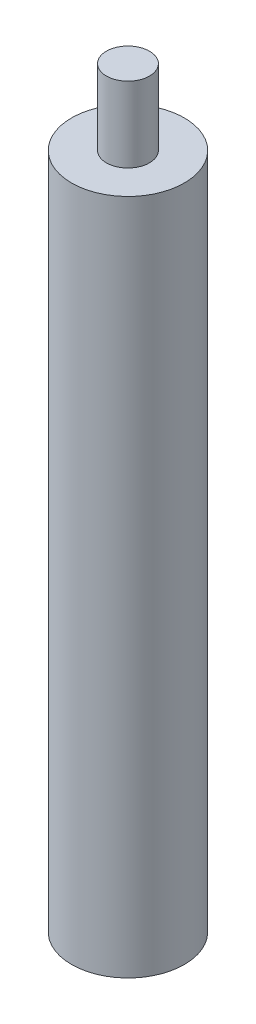
ISO-10303-21;
HEADER;
FILE_DESCRIPTION(('STEP AP214'),'2;1');
FILE_NAME('part.step','',(''),(''),'','','');
FILE_SCHEMA(('AUTOMOTIVE_DESIGN { 1 0 10303 214 1 1 1 1 }'));
ENDSEC;
DATA;
#1=APPLICATION_CONTEXT('core data for automotive mechanical design processes');
#2=APPLICATION_PROTOCOL_DEFINITION('international standard','automotive_design',2000,#1);
#3=PRODUCT_CONTEXT('',#1,'mechanical');
#4=PRODUCT('Part','Part','',(#3));
#5=PRODUCT_RELATED_PRODUCT_CATEGORY('part','',(#4));
#6=PRODUCT_DEFINITION_FORMATION('','',#4);
#7=PRODUCT_DEFINITION_CONTEXT('part definition',#1,'design');
#8=PRODUCT_DEFINITION('design','',#6,#7);
#9=PRODUCT_DEFINITION_SHAPE('','',#8);
#10=(LENGTH_UNIT() NAMED_UNIT(*) SI_UNIT(.MILLI.,.METRE.));
#11=(NAMED_UNIT(*) PLANE_ANGLE_UNIT() SI_UNIT($,.RADIAN.));
#12=(NAMED_UNIT(*) SI_UNIT($,.STERADIAN.) SOLID_ANGLE_UNIT());
#13=UNCERTAINTY_MEASURE_WITH_UNIT(LENGTH_MEASURE(1.E-05),#10,'distance_accuracy_value','');
#14=(GEOMETRIC_REPRESENTATION_CONTEXT(3) GLOBAL_UNCERTAINTY_ASSIGNED_CONTEXT((#13)) GLOBAL_UNIT_ASSIGNED_CONTEXT((#10,
#11,#12)) REPRESENTATION_CONTEXT('',''));
#15=CARTESIAN_POINT('',(0.,0.,0.));
#16=DIRECTION('',(0.,0.,1.));
#17=DIRECTION('',(1.,0.,0.));
#18=AXIS2_PLACEMENT_3D('',#15,#16,#17);
#19=CARTESIAN_POINT('',(0.,114.3,0.));
#20=DIRECTION('',(0.,-1.,0.));
#21=DIRECTION('',(0.,0.,-1.));
#22=AXIS2_PLACEMENT_3D('',#19,#20,#21);
#23=CYLINDRICAL_SURFACE('',#22,9.525);
#24=CARTESIAN_POINT('',(0.,114.3,0.));
#25=DIRECTION('',(0.,1.,0.));
#26=DIRECTION('',(0.,0.,1.));
#27=AXIS2_PLACEMENT_3D('',#24,#25,#26);
#28=CIRCLE('',#27,9.525);
#29=CARTESIAN_POINT('',(0.,114.3,9.525));
#30=VERTEX_POINT('',#29);
#31=EDGE_CURVE('E44',#30,#30,#28,.T.);
#32=ORIENTED_EDGE('',*,*,#31,.F.);
#33=EDGE_LOOP('',(#32));
#34=FACE_BOUND('',#33,.T.);
#35=CARTESIAN_POINT('',(0.,0.,0.));
#36=DIRECTION('',(0.,1.,0.));
#37=DIRECTION('',(0.,0.,1.));
#38=AXIS2_PLACEMENT_3D('',#35,#36,#37);
#39=CIRCLE('',#38,9.525);
#40=CARTESIAN_POINT('',(0.,0.,9.525));
#41=VERTEX_POINT('',#40);
#42=EDGE_CURVE('E40',#41,#41,#39,.T.);
#43=ORIENTED_EDGE('',*,*,#42,.T.);
#44=EDGE_LOOP('',(#43));
#45=FACE_BOUND('',#44,.T.);
#46=ADVANCED_FACE('F37',(#34,#45),#23,.T.);
#47=CARTESIAN_POINT('',(0.,114.3,0.));
#48=DIRECTION('',(0.,1.,0.));
#49=DIRECTION('',(0.,0.,1.));
#50=AXIS2_PLACEMENT_3D('',#47,#48,#49);
#51=PLANE('',#50);
#52=CARTESIAN_POINT('',(0.,114.3,0.));
#53=DIRECTION('',(0.,1.,0.));
#54=DIRECTION('',(0.,0.,1.));
#55=AXIS2_PLACEMENT_3D('',#52,#53,#54);
#56=CIRCLE('',#55,3.63855);
#57=CARTESIAN_POINT('',(0.,114.3,3.63855));
#58=VERTEX_POINT('',#57);
#59=EDGE_CURVE('E10',#58,#58,#56,.T.);
#60=ORIENTED_EDGE('',*,*,#59,.F.);
#61=EDGE_LOOP('',(#60));
#62=FACE_BOUND('',#61,.T.);
#63=ORIENTED_EDGE('',*,*,#31,.T.);
#64=EDGE_LOOP('',(#63));
#65=FACE_BOUND('',#64,.T.);
#66=ADVANCED_FACE('F73',(#62,#65),#51,.T.);
#67=CARTESIAN_POINT('',(0.,0.,0.));
#68=DIRECTION('',(0.,1.,0.));
#69=DIRECTION('',(0.,0.,1.));
#70=AXIS2_PLACEMENT_3D('',#67,#68,#69);
#71=PLANE('',#70);
#72=CARTESIAN_POINT('',(0.,0.,0.));
#73=DIRECTION('',(0.,-1.,0.));
#74=DIRECTION('',(0.,0.,-1.));
#75=AXIS2_PLACEMENT_3D('',#72,#73,#74);
#76=CIRCLE('',#75,3.51155);
#77=CARTESIAN_POINT('',(0.,0.,-3.51155));
#78=VERTEX_POINT('',#77);
#79=EDGE_CURVE('E54',#78,#78,#76,.T.);
#80=ORIENTED_EDGE('',*,*,#79,.F.);
#81=EDGE_LOOP('',(#80));
#82=FACE_BOUND('',#81,.T.);
#83=ORIENTED_EDGE('',*,*,#42,.F.);
#84=EDGE_LOOP('',(#83));
#85=FACE_BOUND('',#84,.T.);
#86=ADVANCED_FACE('F69',(#82,#85),#71,.F.);
#87=CARTESIAN_POINT('',(0.,127.,0.));
#88=DIRECTION('',(0.,-1.,0.));
#89=DIRECTION('',(0.,0.,-1.));
#90=AXIS2_PLACEMENT_3D('',#87,#88,#89);
#91=CYLINDRICAL_SURFACE('',#90,3.63855);
#92=CARTESIAN_POINT('',(0.,127.,0.));
#93=DIRECTION('',(0.,1.,0.));
#94=DIRECTION('',(0.,0.,1.));
#95=AXIS2_PLACEMENT_3D('',#92,#93,#94);
#96=CIRCLE('',#95,3.63855);
#97=CARTESIAN_POINT('',(0.,127.,3.63855));
#98=VERTEX_POINT('',#97);
#99=EDGE_CURVE('E50',#98,#98,#96,.T.);
#100=ORIENTED_EDGE('',*,*,#99,.F.);
#101=EDGE_LOOP('',(#100));
#102=FACE_BOUND('',#101,.T.);
#103=ORIENTED_EDGE('',*,*,#59,.T.);
#104=EDGE_LOOP('',(#103));
#105=FACE_BOUND('',#104,.T.);
#106=ADVANCED_FACE('F72',(#102,#105),#91,.T.);
#107=CARTESIAN_POINT('',(0.,127.,0.));
#108=DIRECTION('',(0.,1.,0.));
#109=DIRECTION('',(0.,0.,1.));
#110=AXIS2_PLACEMENT_3D('',#107,#108,#109);
#111=PLANE('',#110);
#112=ORIENTED_EDGE('',*,*,#99,.T.);
#113=EDGE_LOOP('',(#112));
#114=FACE_BOUND('',#113,.T.);
#115=ADVANCED_FACE('F65',(#114),#111,.T.);
#116=CARTESIAN_POINT('',(0.,12.7,0.));
#117=DIRECTION('',(0.,-1.,0.));
#118=DIRECTION('',(0.,0.,-1.));
#119=AXIS2_PLACEMENT_3D('',#116,#117,#118);
#120=CYLINDRICAL_SURFACE('',#119,3.51155);
#121=CARTESIAN_POINT('',(0.,12.7,0.));
#122=DIRECTION('',(0.,-1.,0.));
#123=DIRECTION('',(0.,0.,-1.));
#124=AXIS2_PLACEMENT_3D('',#121,#122,#123);
#125=CIRCLE('',#124,3.51155);
#126=CARTESIAN_POINT('',(0.,12.7,-3.51155));
#127=VERTEX_POINT('',#126);
#128=EDGE_CURVE('E53',#127,#127,#125,.T.);
#129=ORIENTED_EDGE('',*,*,#128,.F.);
#130=EDGE_LOOP('',(#129));
#131=FACE_BOUND('',#130,.T.);
#132=ORIENTED_EDGE('',*,*,#79,.T.);
#133=EDGE_LOOP('',(#132));
#134=FACE_BOUND('',#133,.T.);
#135=ADVANCED_FACE('F62',(#131,#134),#120,.F.);
#136=CARTESIAN_POINT('',(0.,12.7,0.));
#137=DIRECTION('',(0.,-1.,0.));
#138=DIRECTION('',(0.,0.,-1.));
#139=AXIS2_PLACEMENT_3D('',#136,#137,#138);
#140=PLANE('',#139);
#141=ORIENTED_EDGE('',*,*,#128,.T.);
#142=EDGE_LOOP('',(#141));
#143=FACE_BOUND('',#142,.T.);
#144=ADVANCED_FACE('F60',(#143),#140,.T.);
#145=CLOSED_SHELL('',(#46,#66,#86,#106,#115,#135,#144));
#146=MANIFOLD_SOLID_BREP('B2',#145);
#147=ADVANCED_BREP_SHAPE_REPRESENTATION('',(#18,#146),#14);
#148=SHAPE_DEFINITION_REPRESENTATION(#9,#147);
ENDSEC;
END-ISO-10303-21;
